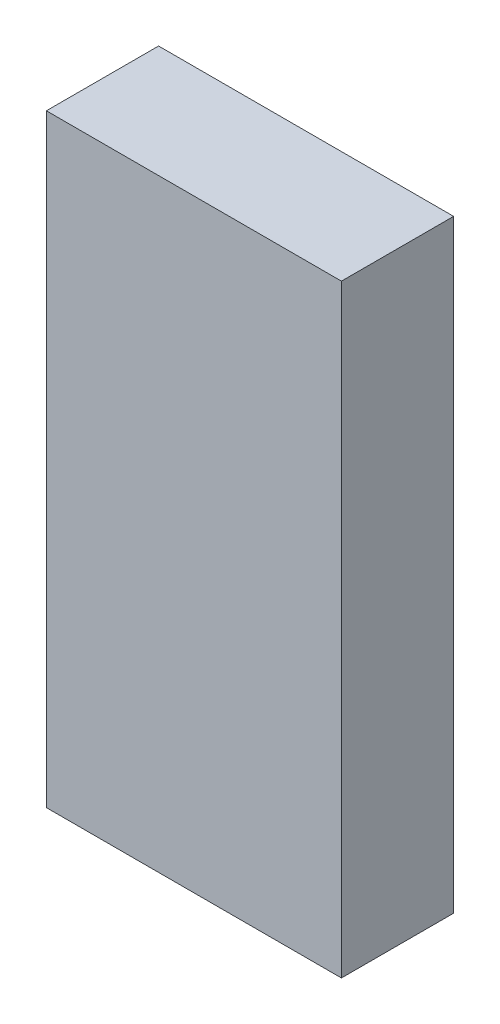
ISO-10303-21;
HEADER;
FILE_DESCRIPTION(('STEP AP214'),'2;1');
FILE_NAME('part.step','',(''),(''),'','','');
FILE_SCHEMA(('AUTOMOTIVE_DESIGN { 1 0 10303 214 1 1 1 1 }'));
ENDSEC;
DATA;
#1=APPLICATION_CONTEXT('core data for automotive mechanical design processes');
#2=APPLICATION_PROTOCOL_DEFINITION('international standard','automotive_design',2000,#1);
#3=PRODUCT_CONTEXT('',#1,'mechanical');
#4=PRODUCT('Part','Part','',(#3));
#5=PRODUCT_RELATED_PRODUCT_CATEGORY('part','',(#4));
#6=PRODUCT_DEFINITION_FORMATION('','',#4);
#7=PRODUCT_DEFINITION_CONTEXT('part definition',#1,'design');
#8=PRODUCT_DEFINITION('design','',#6,#7);
#9=PRODUCT_DEFINITION_SHAPE('','',#8);
#10=(LENGTH_UNIT() NAMED_UNIT(*) SI_UNIT(.MILLI.,.METRE.));
#11=(NAMED_UNIT(*) PLANE_ANGLE_UNIT() SI_UNIT($,.RADIAN.));
#12=(NAMED_UNIT(*) SI_UNIT($,.STERADIAN.) SOLID_ANGLE_UNIT());
#13=UNCERTAINTY_MEASURE_WITH_UNIT(LENGTH_MEASURE(1.E-05),#10,'distance_accuracy_value','');
#14=(GEOMETRIC_REPRESENTATION_CONTEXT(3) GLOBAL_UNCERTAINTY_ASSIGNED_CONTEXT((#13)) GLOBAL_UNIT_ASSIGNED_CONTEXT((#10,
#11,#12)) REPRESENTATION_CONTEXT('',''));
#15=CARTESIAN_POINT('',(0.,0.,0.));
#16=DIRECTION('',(0.,0.,1.));
#17=DIRECTION('',(1.,0.,0.));
#18=AXIS2_PLACEMENT_3D('',#15,#16,#17);
#19=CARTESIAN_POINT('',(0.5588,-1.143,0.42499788));
#20=DIRECTION('',(0.,0.,-1.));
#21=DIRECTION('',(0.,-1.,0.));
#22=AXIS2_PLACEMENT_3D('',#19,#20,#21);
#23=PLANE('',#22);
#24=DIRECTION('',(0.,1.,0.));
#25=VECTOR('',#24,1.);
#26=CARTESIAN_POINT('',(0.5588,-1.143,0.42499788));
#27=LINE('',#26,#25);
#28=CARTESIAN_POINT('',(0.5588,-1.143,0.42499788));
#29=VERTEX_POINT('',#28);
#30=CARTESIAN_POINT('',(0.5588,1.143,0.42499788));
#31=VERTEX_POINT('',#30);
#32=EDGE_CURVE('E90',#29,#31,#27,.T.);
#33=ORIENTED_EDGE('',*,*,#32,.T.);
#34=DIRECTION('',(-1.,0.,0.));
#35=VECTOR('',#34,1.);
#36=CARTESIAN_POINT('',(0.5588,1.143,0.42499788));
#37=LINE('',#36,#35);
#38=CARTESIAN_POINT('',(-0.5588,1.143,0.42499788));
#39=VERTEX_POINT('',#38);
#40=EDGE_CURVE('E89',#31,#39,#37,.T.);
#41=ORIENTED_EDGE('',*,*,#40,.T.);
#42=DIRECTION('',(0.,-1.,0.));
#43=VECTOR('',#42,1.);
#44=CARTESIAN_POINT('',(-0.5588,1.143,0.42499788));
#45=LINE('',#44,#43);
#46=CARTESIAN_POINT('',(-0.5588,-1.143,0.42499788));
#47=VERTEX_POINT('',#46);
#48=EDGE_CURVE('E81',#39,#47,#45,.T.);
#49=ORIENTED_EDGE('',*,*,#48,.T.);
#50=DIRECTION('',(1.,0.,0.));
#51=VECTOR('',#50,1.);
#52=CARTESIAN_POINT('',(-0.5588,-1.143,0.42499788));
#53=LINE('',#52,#51);
#54=EDGE_CURVE('E11',#47,#29,#53,.T.);
#55=ORIENTED_EDGE('',*,*,#54,.T.);
#56=EDGE_LOOP('',(#33,#41,#49,#55));
#57=FACE_BOUND('',#56,.T.);
#58=ADVANCED_FACE('F17',(#57),#23,.F.);
#59=CARTESIAN_POINT('',(0.5588,-1.143,0.));
#60=DIRECTION('',(0.,0.,-1.));
#61=DIRECTION('',(0.,-1.,0.));
#62=AXIS2_PLACEMENT_3D('',#59,#60,#61);
#63=PLANE('',#62);
#64=DIRECTION('',(0.,1.,0.));
#65=VECTOR('',#64,1.);
#66=CARTESIAN_POINT('',(0.5588,-1.143,0.));
#67=LINE('',#66,#65);
#68=CARTESIAN_POINT('',(0.5588,-1.143,0.));
#69=VERTEX_POINT('',#68);
#70=CARTESIAN_POINT('',(0.5588,1.143,0.));
#71=VERTEX_POINT('',#70);
#72=EDGE_CURVE('E104',#69,#71,#67,.T.);
#73=ORIENTED_EDGE('',*,*,#72,.F.);
#74=DIRECTION('',(1.,0.,0.));
#75=VECTOR('',#74,1.);
#76=CARTESIAN_POINT('',(-0.5588,-1.143,0.));
#77=LINE('',#76,#75);
#78=CARTESIAN_POINT('',(-0.5588,-1.143,0.));
#79=VERTEX_POINT('',#78);
#80=EDGE_CURVE('E21',#79,#69,#77,.T.);
#81=ORIENTED_EDGE('',*,*,#80,.F.);
#82=DIRECTION('',(0.,-1.,0.));
#83=VECTOR('',#82,1.);
#84=CARTESIAN_POINT('',(-0.5588,1.143,0.));
#85=LINE('',#84,#83);
#86=CARTESIAN_POINT('',(-0.5588,1.143,0.));
#87=VERTEX_POINT('',#86);
#88=EDGE_CURVE('E73',#87,#79,#85,.T.);
#89=ORIENTED_EDGE('',*,*,#88,.F.);
#90=DIRECTION('',(-1.,0.,0.));
#91=VECTOR('',#90,1.);
#92=CARTESIAN_POINT('',(0.5588,1.143,0.));
#93=LINE('',#92,#91);
#94=EDGE_CURVE('E56',#71,#87,#93,.T.);
#95=ORIENTED_EDGE('',*,*,#94,.F.);
#96=EDGE_LOOP('',(#73,#81,#89,#95));
#97=FACE_BOUND('',#96,.T.);
#98=ADVANCED_FACE('F122',(#97),#63,.T.);
#99=CARTESIAN_POINT('',(-0.5588,-1.143,0.));
#100=DIRECTION('',(0.,1.,0.));
#101=DIRECTION('',(1.,0.,0.));
#102=AXIS2_PLACEMENT_3D('',#99,#100,#101);
#103=PLANE('',#102);
#104=DIRECTION('',(0.,0.,1.));
#105=VECTOR('',#104,1.);
#106=CARTESIAN_POINT('',(-0.5588,-1.143,0.));
#107=LINE('',#106,#105);
#108=EDGE_CURVE('E86',#79,#47,#107,.T.);
#109=ORIENTED_EDGE('',*,*,#108,.F.);
#110=ORIENTED_EDGE('',*,*,#80,.T.);
#111=DIRECTION('',(0.,0.,1.));
#112=VECTOR('',#111,1.);
#113=CARTESIAN_POINT('',(0.5588,-1.143,0.));
#114=LINE('',#113,#112);
#115=EDGE_CURVE('E108',#69,#29,#114,.T.);
#116=ORIENTED_EDGE('',*,*,#115,.T.);
#117=ORIENTED_EDGE('',*,*,#54,.F.);
#118=EDGE_LOOP('',(#109,#110,#116,#117));
#119=FACE_BOUND('',#118,.T.);
#120=ADVANCED_FACE('F124',(#119),#103,.F.);
#121=CARTESIAN_POINT('',(-0.5588,1.143,0.));
#122=DIRECTION('',(1.,0.,0.));
#123=DIRECTION('',(0.,1.,0.));
#124=AXIS2_PLACEMENT_3D('',#121,#122,#123);
#125=PLANE('',#124);
#126=DIRECTION('',(0.,0.,1.));
#127=VECTOR('',#126,1.);
#128=CARTESIAN_POINT('',(-0.5588,1.143,0.));
#129=LINE('',#128,#127);
#130=EDGE_CURVE('E85',#87,#39,#129,.T.);
#131=ORIENTED_EDGE('',*,*,#130,.F.);
#132=ORIENTED_EDGE('',*,*,#88,.T.);
#133=ORIENTED_EDGE('',*,*,#108,.T.);
#134=ORIENTED_EDGE('',*,*,#48,.F.);
#135=EDGE_LOOP('',(#131,#132,#133,#134));
#136=FACE_BOUND('',#135,.T.);
#137=ADVANCED_FACE('F83',(#136),#125,.F.);
#138=CARTESIAN_POINT('',(0.5588,1.143,0.));
#139=DIRECTION('',(0.,-1.,0.));
#140=DIRECTION('',(0.,0.,-1.));
#141=AXIS2_PLACEMENT_3D('',#138,#139,#140);
#142=PLANE('',#141);
#143=DIRECTION('',(0.,0.,1.));
#144=VECTOR('',#143,1.);
#145=CARTESIAN_POINT('',(0.5588,1.143,0.));
#146=LINE('',#145,#144);
#147=EDGE_CURVE('E106',#71,#31,#146,.T.);
#148=ORIENTED_EDGE('',*,*,#147,.F.);
#149=ORIENTED_EDGE('',*,*,#94,.T.);
#150=ORIENTED_EDGE('',*,*,#130,.T.);
#151=ORIENTED_EDGE('',*,*,#40,.F.);
#152=EDGE_LOOP('',(#148,#149,#150,#151));
#153=FACE_BOUND('',#152,.T.);
#154=ADVANCED_FACE('F19',(#153),#142,.F.);
#155=CARTESIAN_POINT('',(0.5588,-1.143,0.));
#156=DIRECTION('',(-1.,0.,0.));
#157=DIRECTION('',(0.,0.,1.));
#158=AXIS2_PLACEMENT_3D('',#155,#156,#157);
#159=PLANE('',#158);
#160=ORIENTED_EDGE('',*,*,#115,.F.);
#161=ORIENTED_EDGE('',*,*,#72,.T.);
#162=ORIENTED_EDGE('',*,*,#147,.T.);
#163=ORIENTED_EDGE('',*,*,#32,.F.);
#164=EDGE_LOOP('',(#160,#161,#162,#163));
#165=FACE_BOUND('',#164,.T.);
#166=ADVANCED_FACE('F121',(#165),#159,.F.);
#167=CLOSED_SHELL('',(#58,#98,#120,#137,#154,#166));
#168=MANIFOLD_SOLID_BREP('B1',#167);
#169=ADVANCED_BREP_SHAPE_REPRESENTATION('',(#18,#168),#14);
#170=SHAPE_DEFINITION_REPRESENTATION(#9,#169);
ENDSEC;
END-ISO-10303-21;
